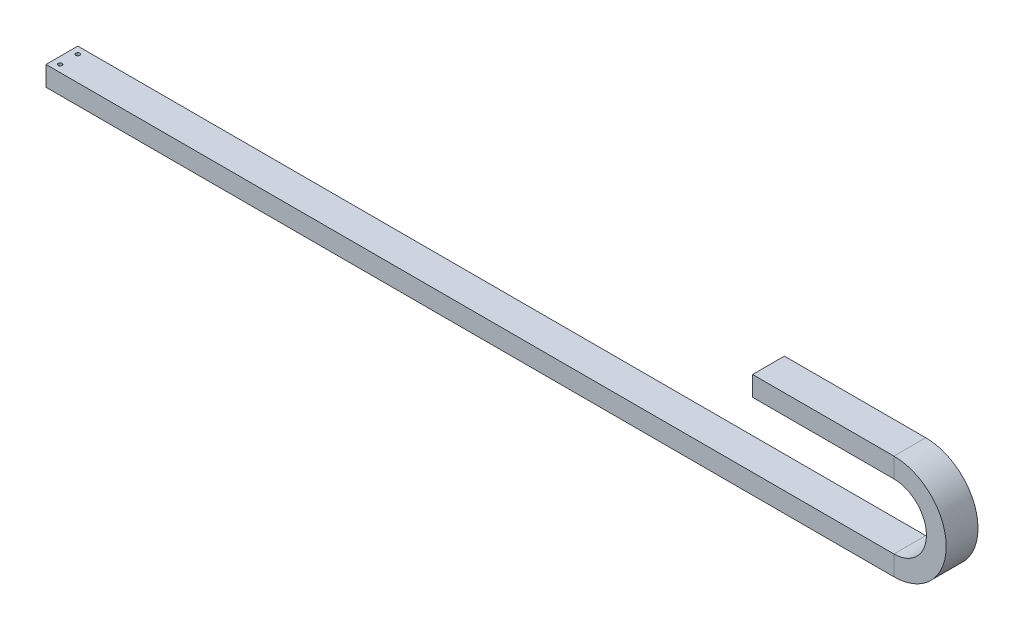
ISO-10303-21;
HEADER;
FILE_DESCRIPTION(('STEP AP214'),'2;1');
FILE_NAME('part.step','',(''),(''),'','','');
FILE_SCHEMA(('AUTOMOTIVE_DESIGN { 1 0 10303 214 1 1 1 1 }'));
ENDSEC;
DATA;
#1=APPLICATION_CONTEXT('core data for automotive mechanical design processes');
#2=APPLICATION_PROTOCOL_DEFINITION('international standard','automotive_design',2000,#1);
#3=PRODUCT_CONTEXT('',#1,'mechanical');
#4=PRODUCT('Part','Part','',(#3));
#5=PRODUCT_RELATED_PRODUCT_CATEGORY('part','',(#4));
#6=PRODUCT_DEFINITION_FORMATION('','',#4);
#7=PRODUCT_DEFINITION_CONTEXT('part definition',#1,'design');
#8=PRODUCT_DEFINITION('design','',#6,#7);
#9=PRODUCT_DEFINITION_SHAPE('','',#8);
#10=(LENGTH_UNIT() NAMED_UNIT(*) SI_UNIT(.MILLI.,.METRE.));
#11=(NAMED_UNIT(*) PLANE_ANGLE_UNIT() SI_UNIT($,.RADIAN.));
#12=(NAMED_UNIT(*) SI_UNIT($,.STERADIAN.) SOLID_ANGLE_UNIT());
#13=UNCERTAINTY_MEASURE_WITH_UNIT(LENGTH_MEASURE(1.E-05),#10,'distance_accuracy_value','');
#14=(GEOMETRIC_REPRESENTATION_CONTEXT(3) GLOBAL_UNCERTAINTY_ASSIGNED_CONTEXT((#13)) GLOBAL_UNIT_ASSIGNED_CONTEXT((#10,
#11,#12)) REPRESENTATION_CONTEXT('',''));
#15=CARTESIAN_POINT('',(0.,0.,0.));
#16=DIRECTION('',(0.,0.,1.));
#17=DIRECTION('',(1.,0.,0.));
#18=AXIS2_PLACEMENT_3D('',#15,#16,#17);
#19=CARTESIAN_POINT('',(0.,-14.,-22.5));
#20=DIRECTION('',(0.,0.,-1.));
#21=DIRECTION('',(-1.,0.,0.));
#22=AXIS2_PLACEMENT_3D('',#19,#20,#21);
#23=PLANE('',#22);
#24=DIRECTION('',(1.,0.,0.));
#25=VECTOR('',#24,1.);
#26=CARTESIAN_POINT('',(0.,14.,-22.5));
#27=LINE('',#26,#25);
#28=CARTESIAN_POINT('',(0.,14.,-22.5));
#29=VERTEX_POINT('',#28);
#30=CARTESIAN_POINT('',(1200.,14.,-22.5));
#31=VERTEX_POINT('',#30);
#32=EDGE_CURVE('E276',#29,#31,#27,.T.);
#33=ORIENTED_EDGE('',*,*,#32,.T.);
#34=DIRECTION('',(0.,1.,0.));
#35=VECTOR('',#34,1.);
#36=CARTESIAN_POINT('',(1200.,-14.,-22.5));
#37=LINE('',#36,#35);
#38=CARTESIAN_POINT('',(1200.,-14.,-22.5));
#39=VERTEX_POINT('',#38);
#40=EDGE_CURVE('E273',#39,#31,#37,.T.);
#41=ORIENTED_EDGE('',*,*,#40,.F.);
#42=DIRECTION('',(1.,0.,0.));
#43=VECTOR('',#42,1.);
#44=CARTESIAN_POINT('',(0.,-14.,-22.5));
#45=LINE('',#44,#43);
#46=CARTESIAN_POINT('',(0.,-14.,-22.5));
#47=VERTEX_POINT('',#46);
#48=EDGE_CURVE('E131',#47,#39,#45,.T.);
#49=ORIENTED_EDGE('',*,*,#48,.F.);
#50=DIRECTION('',(0.,1.,0.));
#51=VECTOR('',#50,1.);
#52=CARTESIAN_POINT('',(0.,-14.,-22.5));
#53=LINE('',#52,#51);
#54=EDGE_CURVE('E157',#47,#29,#53,.T.);
#55=ORIENTED_EDGE('',*,*,#54,.T.);
#56=EDGE_LOOP('',(#33,#41,#49,#55));
#57=FACE_BOUND('',#56,.T.);
#58=ADVANCED_FACE('F35',(#57),#23,.T.);
#59=CARTESIAN_POINT('',(0.,14.,22.5));
#60=DIRECTION('',(0.,1.,0.));
#61=DIRECTION('',(0.,0.,1.));
#62=AXIS2_PLACEMENT_3D('',#59,#60,#61);
#63=PLANE('',#62);
#64=CARTESIAN_POINT('',(10.,14.,-12.5));
#65=DIRECTION('',(0.,1.,0.));
#66=DIRECTION('',(0.,0.,1.));
#67=AXIS2_PLACEMENT_3D('',#64,#65,#66);
#68=CIRCLE('',#67,2.75);
#69=CARTESIAN_POINT('',(10.,14.,-9.75));
#70=VERTEX_POINT('',#69);
#71=EDGE_CURVE('E377',#70,#70,#68,.T.);
#72=ORIENTED_EDGE('',*,*,#71,.F.);
#73=EDGE_LOOP('',(#72));
#74=FACE_BOUND('',#73,.T.);
#75=CARTESIAN_POINT('',(10.,14.,12.5));
#76=DIRECTION('',(0.,1.,0.));
#77=DIRECTION('',(0.,0.,1.));
#78=AXIS2_PLACEMENT_3D('',#75,#76,#77);
#79=CIRCLE('',#78,2.75);
#80=CARTESIAN_POINT('',(10.,14.,15.25));
#81=VERTEX_POINT('',#80);
#82=EDGE_CURVE('E169',#81,#81,#79,.T.);
#83=ORIENTED_EDGE('',*,*,#82,.F.);
#84=EDGE_LOOP('',(#83));
#85=FACE_BOUND('',#84,.T.);
#86=DIRECTION('',(1.,0.,0.));
#87=VECTOR('',#86,1.);
#88=CARTESIAN_POINT('',(0.,14.,22.5));
#89=LINE('',#88,#87);
#90=CARTESIAN_POINT('',(0.,14.,22.5));
#91=VERTEX_POINT('',#90);
#92=CARTESIAN_POINT('',(1200.,14.,22.5));
#93=VERTEX_POINT('',#92);
#94=EDGE_CURVE('E146',#91,#93,#89,.T.);
#95=ORIENTED_EDGE('',*,*,#94,.T.);
#96=DIRECTION('',(0.,0.,1.));
#97=VECTOR('',#96,1.);
#98=CARTESIAN_POINT('',(1200.,14.,22.5));
#99=LINE('',#98,#97);
#100=EDGE_CURVE('E148',#31,#93,#99,.T.);
#101=ORIENTED_EDGE('',*,*,#100,.F.);
#102=ORIENTED_EDGE('',*,*,#32,.F.);
#103=DIRECTION('',(0.,0.,1.));
#104=VECTOR('',#103,1.);
#105=CARTESIAN_POINT('',(0.,14.,22.5));
#106=LINE('',#105,#104);
#107=EDGE_CURVE('E270',#29,#91,#106,.T.);
#108=ORIENTED_EDGE('',*,*,#107,.T.);
#109=EDGE_LOOP('',(#95,#101,#102,#108));
#110=FACE_BOUND('',#109,.T.);
#111=ADVANCED_FACE('F349',(#74,#85,#110),#63,.T.);
#112=CARTESIAN_POINT('',(0.,-14.,22.5));
#113=DIRECTION('',(0.,0.,1.));
#114=DIRECTION('',(1.,0.,0.));
#115=AXIS2_PLACEMENT_3D('',#112,#113,#114);
#116=PLANE('',#115);
#117=DIRECTION('',(1.,0.,0.));
#118=VECTOR('',#117,1.);
#119=CARTESIAN_POINT('',(0.,-14.,22.5));
#120=LINE('',#119,#118);
#121=CARTESIAN_POINT('',(0.,-14.,22.5));
#122=VERTEX_POINT('',#121);
#123=CARTESIAN_POINT('',(1200.,-14.,22.5));
#124=VERTEX_POINT('',#123);
#125=EDGE_CURVE('E128',#122,#124,#120,.T.);
#126=ORIENTED_EDGE('',*,*,#125,.T.);
#127=DIRECTION('',(0.,-1.,0.));
#128=VECTOR('',#127,1.);
#129=CARTESIAN_POINT('',(1200.,-14.,22.5));
#130=LINE('',#129,#128);
#131=EDGE_CURVE('E138',#93,#124,#130,.T.);
#132=ORIENTED_EDGE('',*,*,#131,.F.);
#133=ORIENTED_EDGE('',*,*,#94,.F.);
#134=DIRECTION('',(0.,-1.,0.));
#135=VECTOR('',#134,1.);
#136=CARTESIAN_POINT('',(0.,-14.,22.5));
#137=LINE('',#136,#135);
#138=EDGE_CURVE('E141',#91,#122,#137,.T.);
#139=ORIENTED_EDGE('',*,*,#138,.T.);
#140=EDGE_LOOP('',(#126,#132,#133,#139));
#141=FACE_BOUND('',#140,.T.);
#142=ADVANCED_FACE('F136',(#141),#116,.T.);
#143=CARTESIAN_POINT('',(0.,-14.,22.5));
#144=DIRECTION('',(0.,-1.,0.));
#145=DIRECTION('',(0.,0.,-1.));
#146=AXIS2_PLACEMENT_3D('',#143,#144,#145);
#147=PLANE('',#146);
#148=CARTESIAN_POINT('',(10.,-14.,-12.5));
#149=DIRECTION('',(0.,1.,0.));
#150=DIRECTION('',(0.,0.,1.));
#151=AXIS2_PLACEMENT_3D('',#148,#149,#150);
#152=CIRCLE('',#151,2.74999999999999);
#153=CARTESIAN_POINT('',(10.,-14.,-9.75000000000001));
#154=VERTEX_POINT('',#153);
#155=EDGE_CURVE('E375',#154,#154,#152,.T.);
#156=ORIENTED_EDGE('',*,*,#155,.T.);
#157=EDGE_LOOP('',(#156));
#158=FACE_BOUND('',#157,.T.);
#159=CARTESIAN_POINT('',(10.,-14.,12.5));
#160=DIRECTION('',(0.,1.,0.));
#161=DIRECTION('',(0.,0.,1.));
#162=AXIS2_PLACEMENT_3D('',#159,#160,#161);
#163=CIRCLE('',#162,2.74999999999999);
#164=CARTESIAN_POINT('',(10.,-14.,15.25));
#165=VERTEX_POINT('',#164);
#166=EDGE_CURVE('E163',#165,#165,#163,.T.);
#167=ORIENTED_EDGE('',*,*,#166,.T.);
#168=EDGE_LOOP('',(#167));
#169=FACE_BOUND('',#168,.T.);
#170=DIRECTION('',(0.,0.,-1.));
#171=VECTOR('',#170,1.);
#172=CARTESIAN_POINT('',(1200.,-14.,22.5));
#173=LINE('',#172,#171);
#174=EDGE_CURVE('E113',#124,#39,#173,.T.);
#175=ORIENTED_EDGE('',*,*,#174,.F.);
#176=ORIENTED_EDGE('',*,*,#125,.F.);
#177=DIRECTION('',(0.,0.,-1.));
#178=VECTOR('',#177,1.);
#179=CARTESIAN_POINT('',(0.,-14.,22.5));
#180=LINE('',#179,#178);
#181=EDGE_CURVE('E263',#122,#47,#180,.T.);
#182=ORIENTED_EDGE('',*,*,#181,.T.);
#183=ORIENTED_EDGE('',*,*,#48,.T.);
#184=EDGE_LOOP('',(#175,#176,#182,#183));
#185=FACE_BOUND('',#184,.T.);
#186=ADVANCED_FACE('F127',(#158,#169,#185),#147,.T.);
#187=CARTESIAN_POINT('',(1200.,-14.,-22.5));
#188=DIRECTION('',(0.,0.,-1.));
#189=DIRECTION('',(-1.,0.,0.));
#190=AXIS2_PLACEMENT_3D('',#187,#188,#189);
#191=PLANE('',#190);
#192=CARTESIAN_POINT('',(1200.,60.,-22.5));
#193=DIRECTION('',(0.,0.,1.));
#194=DIRECTION('',(0.,-1.,0.));
#195=AXIS2_PLACEMENT_3D('',#192,#193,#194);
#196=CIRCLE('',#195,46.);
#197=CARTESIAN_POINT('',(1200.,106.,-22.5));
#198=VERTEX_POINT('',#197);
#199=EDGE_CURVE('E283',#31,#198,#196,.T.);
#200=ORIENTED_EDGE('',*,*,#199,.T.);
#201=DIRECTION('',(0.,-1.,0.));
#202=VECTOR('',#201,1.);
#203=CARTESIAN_POINT('',(1200.,134.,-22.5));
#204=LINE('',#203,#202);
#205=CARTESIAN_POINT('',(1200.,134.,-22.5));
#206=VERTEX_POINT('',#205);
#207=EDGE_CURVE('E280',#206,#198,#204,.T.);
#208=ORIENTED_EDGE('',*,*,#207,.F.);
#209=CARTESIAN_POINT('',(1200.,60.,-22.5));
#210=DIRECTION('',(0.,0.,1.));
#211=DIRECTION('',(0.,-1.,0.));
#212=AXIS2_PLACEMENT_3D('',#209,#210,#211);
#213=CIRCLE('',#212,74.);
#214=EDGE_CURVE('E132',#39,#206,#213,.T.);
#215=ORIENTED_EDGE('',*,*,#214,.F.);
#216=ORIENTED_EDGE('',*,*,#40,.T.);
#217=EDGE_LOOP('',(#200,#208,#215,#216));
#218=FACE_BOUND('',#217,.T.);
#219=ADVANCED_FACE('F351',(#218),#191,.T.);
#220=CARTESIAN_POINT('',(1200.,60.,0.));
#221=DIRECTION('',(0.,0.,1.));
#222=DIRECTION('',(1.,0.,0.));
#223=AXIS2_PLACEMENT_3D('',#220,#221,#222);
#224=CYLINDRICAL_SURFACE('',#223,46.);
#225=CARTESIAN_POINT('',(1200.,60.,22.5));
#226=DIRECTION('',(0.,0.,1.));
#227=DIRECTION('',(0.,-1.,0.));
#228=AXIS2_PLACEMENT_3D('',#225,#226,#227);
#229=CIRCLE('',#228,46.);
#230=CARTESIAN_POINT('',(1200.,106.,22.5));
#231=VERTEX_POINT('',#230);
#232=EDGE_CURVE('E145',#93,#231,#229,.T.);
#233=ORIENTED_EDGE('',*,*,#232,.T.);
#234=DIRECTION('',(0.,0.,1.));
#235=VECTOR('',#234,1.);
#236=CARTESIAN_POINT('',(1200.,106.,22.5));
#237=LINE('',#236,#235);
#238=EDGE_CURVE('E286',#198,#231,#237,.T.);
#239=ORIENTED_EDGE('',*,*,#238,.F.);
#240=ORIENTED_EDGE('',*,*,#199,.F.);
#241=ORIENTED_EDGE('',*,*,#100,.T.);
#242=EDGE_LOOP('',(#233,#239,#240,#241));
#243=FACE_BOUND('',#242,.T.);
#244=ADVANCED_FACE('F298',(#243),#224,.F.);
#245=CARTESIAN_POINT('',(1200.,-14.,22.5));
#246=DIRECTION('',(0.,0.,1.));
#247=DIRECTION('',(1.,0.,0.));
#248=AXIS2_PLACEMENT_3D('',#245,#246,#247);
#249=PLANE('',#248);
#250=CARTESIAN_POINT('',(1200.,60.,22.5));
#251=DIRECTION('',(0.,0.,1.));
#252=DIRECTION('',(0.,-1.,0.));
#253=AXIS2_PLACEMENT_3D('',#250,#251,#252);
#254=CIRCLE('',#253,74.);
#255=CARTESIAN_POINT('',(1200.,134.,22.5));
#256=VERTEX_POINT('',#255);
#257=EDGE_CURVE('E109',#124,#256,#254,.T.);
#258=ORIENTED_EDGE('',*,*,#257,.T.);
#259=DIRECTION('',(0.,1.,0.));
#260=VECTOR('',#259,1.);
#261=CARTESIAN_POINT('',(1200.,134.,22.5));
#262=LINE('',#261,#260);
#263=EDGE_CURVE('E121',#231,#256,#262,.T.);
#264=ORIENTED_EDGE('',*,*,#263,.F.);
#265=ORIENTED_EDGE('',*,*,#232,.F.);
#266=ORIENTED_EDGE('',*,*,#131,.T.);
#267=EDGE_LOOP('',(#258,#264,#265,#266));
#268=FACE_BOUND('',#267,.T.);
#269=ADVANCED_FACE('F143',(#268),#249,.T.);
#270=CARTESIAN_POINT('',(1200.,60.,0.));
#271=DIRECTION('',(0.,0.,1.));
#272=DIRECTION('',(1.,0.,0.));
#273=AXIS2_PLACEMENT_3D('',#270,#271,#272);
#274=CYLINDRICAL_SURFACE('',#273,74.);
#275=DIRECTION('',(0.,0.,-1.));
#276=VECTOR('',#275,1.);
#277=CARTESIAN_POINT('',(1200.,134.,22.5));
#278=LINE('',#277,#276);
#279=EDGE_CURVE('E116',#256,#206,#278,.T.);
#280=ORIENTED_EDGE('',*,*,#279,.F.);
#281=ORIENTED_EDGE('',*,*,#257,.F.);
#282=ORIENTED_EDGE('',*,*,#174,.T.);
#283=ORIENTED_EDGE('',*,*,#214,.T.);
#284=EDGE_LOOP('',(#280,#281,#282,#283));
#285=FACE_BOUND('',#284,.T.);
#286=ADVANCED_FACE('F111',(#285),#274,.T.);
#287=CARTESIAN_POINT('',(1200.,134.,-22.5));
#288=DIRECTION('',(0.,0.,-1.));
#289=DIRECTION('',(-1.,0.,0.));
#290=AXIS2_PLACEMENT_3D('',#287,#288,#289);
#291=PLANE('',#290);
#292=DIRECTION('',(-1.,0.,0.));
#293=VECTOR('',#292,1.);
#294=CARTESIAN_POINT('',(1200.,106.,-22.5));
#295=LINE('',#294,#293);
#296=CARTESIAN_POINT('',(1000.,106.,-22.5));
#297=VERTEX_POINT('',#296);
#298=EDGE_CURVE('E288',#198,#297,#295,.T.);
#299=ORIENTED_EDGE('',*,*,#298,.T.);
#300=DIRECTION('',(0.,-1.,0.));
#301=VECTOR('',#300,1.);
#302=CARTESIAN_POINT('',(1000.,134.,-22.5));
#303=LINE('',#302,#301);
#304=CARTESIAN_POINT('',(1000.,134.,-22.5));
#305=VERTEX_POINT('',#304);
#306=EDGE_CURVE('E259',#305,#297,#303,.T.);
#307=ORIENTED_EDGE('',*,*,#306,.F.);
#308=DIRECTION('',(-1.,0.,0.));
#309=VECTOR('',#308,1.);
#310=CARTESIAN_POINT('',(1200.,134.,-22.5));
#311=LINE('',#310,#309);
#312=EDGE_CURVE('E159',#206,#305,#311,.T.);
#313=ORIENTED_EDGE('',*,*,#312,.F.);
#314=ORIENTED_EDGE('',*,*,#207,.T.);
#315=EDGE_LOOP('',(#299,#307,#313,#314));
#316=FACE_BOUND('',#315,.T.);
#317=ADVANCED_FACE('F304',(#316),#291,.T.);
#318=CARTESIAN_POINT('',(1200.,106.,22.5));
#319=DIRECTION('',(0.,-1.,0.));
#320=DIRECTION('',(1.,0.,0.));
#321=AXIS2_PLACEMENT_3D('',#318,#319,#320);
#322=PLANE('',#321);
#323=DIRECTION('',(-1.,0.,0.));
#324=VECTOR('',#323,1.);
#325=CARTESIAN_POINT('',(1200.,106.,22.5));
#326=LINE('',#325,#324);
#327=CARTESIAN_POINT('',(1000.,106.,22.5));
#328=VERTEX_POINT('',#327);
#329=EDGE_CURVE('E151',#231,#328,#326,.T.);
#330=ORIENTED_EDGE('',*,*,#329,.T.);
#331=DIRECTION('',(0.,0.,1.));
#332=VECTOR('',#331,1.);
#333=CARTESIAN_POINT('',(1000.,106.,22.5));
#334=LINE('',#333,#332);
#335=EDGE_CURVE('E262',#297,#328,#334,.T.);
#336=ORIENTED_EDGE('',*,*,#335,.F.);
#337=ORIENTED_EDGE('',*,*,#298,.F.);
#338=ORIENTED_EDGE('',*,*,#238,.T.);
#339=EDGE_LOOP('',(#330,#336,#337,#338));
#340=FACE_BOUND('',#339,.T.);
#341=ADVANCED_FACE('F302',(#340),#322,.T.);
#342=CARTESIAN_POINT('',(1200.,134.,22.5));
#343=DIRECTION('',(0.,0.,1.));
#344=DIRECTION('',(1.,0.,0.));
#345=AXIS2_PLACEMENT_3D('',#342,#343,#344);
#346=PLANE('',#345);
#347=DIRECTION('',(-1.,0.,0.));
#348=VECTOR('',#347,1.);
#349=CARTESIAN_POINT('',(1200.,134.,22.5));
#350=LINE('',#349,#348);
#351=CARTESIAN_POINT('',(1000.,134.,22.5));
#352=VERTEX_POINT('',#351);
#353=EDGE_CURVE('E155',#256,#352,#350,.T.);
#354=ORIENTED_EDGE('',*,*,#353,.T.);
#355=DIRECTION('',(0.,1.,0.));
#356=VECTOR('',#355,1.);
#357=CARTESIAN_POINT('',(1000.,134.,22.5));
#358=LINE('',#357,#356);
#359=EDGE_CURVE('E258',#328,#352,#358,.T.);
#360=ORIENTED_EDGE('',*,*,#359,.F.);
#361=ORIENTED_EDGE('',*,*,#329,.F.);
#362=ORIENTED_EDGE('',*,*,#263,.T.);
#363=EDGE_LOOP('',(#354,#360,#361,#362));
#364=FACE_BOUND('',#363,.T.);
#365=ADVANCED_FACE('F311',(#364),#346,.T.);
#366=CARTESIAN_POINT('',(1200.,134.,22.5));
#367=DIRECTION('',(0.,1.,0.));
#368=DIRECTION('',(-1.,0.,0.));
#369=AXIS2_PLACEMENT_3D('',#366,#367,#368);
#370=PLANE('',#369);
#371=DIRECTION('',(0.,0.,-1.));
#372=VECTOR('',#371,1.);
#373=CARTESIAN_POINT('',(1000.,134.,22.5));
#374=LINE('',#373,#372);
#375=EDGE_CURVE('E182',#352,#305,#374,.T.);
#376=ORIENTED_EDGE('',*,*,#375,.F.);
#377=ORIENTED_EDGE('',*,*,#353,.F.);
#378=ORIENTED_EDGE('',*,*,#279,.T.);
#379=ORIENTED_EDGE('',*,*,#312,.T.);
#380=EDGE_LOOP('',(#376,#377,#378,#379));
#381=FACE_BOUND('',#380,.T.);
#382=ADVANCED_FACE('F37',(#381),#370,.T.);
#383=CARTESIAN_POINT('',(0.,0.,0.));
#384=DIRECTION('',(-1.,0.,0.));
#385=DIRECTION('',(0.,0.,1.));
#386=AXIS2_PLACEMENT_3D('',#383,#384,#385);
#387=PLANE('',#386);
#388=ORIENTED_EDGE('',*,*,#54,.F.);
#389=ORIENTED_EDGE('',*,*,#181,.F.);
#390=ORIENTED_EDGE('',*,*,#138,.F.);
#391=ORIENTED_EDGE('',*,*,#107,.F.);
#392=EDGE_LOOP('',(#388,#389,#390,#391));
#393=FACE_BOUND('',#392,.T.);
#394=DIRECTION('',(0.,-1.,0.));
#395=VECTOR('',#394,1.);
#396=CARTESIAN_POINT('',(0.,-9.,17.5));
#397=LINE('',#396,#395);
#398=CARTESIAN_POINT('',(0.,-9.,17.5));
#399=VERTEX_POINT('',#398);
#400=CARTESIAN_POINT('',(0.,9.,17.5));
#401=VERTEX_POINT('',#400);
#402=EDGE_CURVE('E193',#399,#401,#397,.F.);
#403=ORIENTED_EDGE('',*,*,#402,.F.);
#404=DIRECTION('',(0.,0.,-1.));
#405=VECTOR('',#404,1.);
#406=CARTESIAN_POINT('',(0.,-9.,-17.5));
#407=LINE('',#406,#405);
#408=CARTESIAN_POINT('',(0.,-9.,-17.5));
#409=VERTEX_POINT('',#408);
#410=EDGE_CURVE('E218',#409,#399,#407,.F.);
#411=ORIENTED_EDGE('',*,*,#410,.F.);
#412=DIRECTION('',(0.,1.,0.));
#413=VECTOR('',#412,1.);
#414=CARTESIAN_POINT('',(0.,-9.,-17.5));
#415=LINE('',#414,#413);
#416=CARTESIAN_POINT('',(0.,9.,-17.5));
#417=VERTEX_POINT('',#416);
#418=EDGE_CURVE('E181',#417,#409,#415,.F.);
#419=ORIENTED_EDGE('',*,*,#418,.F.);
#420=DIRECTION('',(0.,0.,1.));
#421=VECTOR('',#420,1.);
#422=CARTESIAN_POINT('',(0.,9.,-17.5));
#423=LINE('',#422,#421);
#424=EDGE_CURVE('E178',#401,#417,#423,.F.);
#425=ORIENTED_EDGE('',*,*,#424,.F.);
#426=EDGE_LOOP('',(#403,#411,#419,#425));
#427=FACE_BOUND('',#426,.T.);
#428=ADVANCED_FACE('F318',(#393,#427),#387,.T.);
#429=CARTESIAN_POINT('',(1000.,120.,0.));
#430=DIRECTION('',(1.,0.,0.));
#431=DIRECTION('',(0.,0.,1.));
#432=AXIS2_PLACEMENT_3D('',#429,#430,#431);
#433=PLANE('',#432);
#434=ORIENTED_EDGE('',*,*,#306,.T.);
#435=ORIENTED_EDGE('',*,*,#335,.T.);
#436=ORIENTED_EDGE('',*,*,#359,.T.);
#437=ORIENTED_EDGE('',*,*,#375,.T.);
#438=EDGE_LOOP('',(#434,#435,#436,#437));
#439=FACE_BOUND('',#438,.T.);
#440=DIRECTION('',(0.,1.,0.));
#441=VECTOR('',#440,1.);
#442=CARTESIAN_POINT('',(1000.,129.,17.5));
#443=LINE('',#442,#441);
#444=CARTESIAN_POINT('',(1000.,129.,17.5));
#445=VERTEX_POINT('',#444);
#446=CARTESIAN_POINT('',(1000.,111.,17.5));
#447=VERTEX_POINT('',#446);
#448=EDGE_CURVE('E11',#445,#447,#443,.F.);
#449=ORIENTED_EDGE('',*,*,#448,.T.);
#450=DIRECTION('',(0.,0.,1.));
#451=VECTOR('',#450,1.);
#452=CARTESIAN_POINT('',(1000.,111.,-17.5));
#453=LINE('',#452,#451);
#454=CARTESIAN_POINT('',(1000.,111.,-17.5));
#455=VERTEX_POINT('',#454);
#456=EDGE_CURVE('E205',#447,#455,#453,.F.);
#457=ORIENTED_EDGE('',*,*,#456,.T.);
#458=DIRECTION('',(0.,-1.,0.));
#459=VECTOR('',#458,1.);
#460=CARTESIAN_POINT('',(1000.,129.,-17.5));
#461=LINE('',#460,#459);
#462=CARTESIAN_POINT('',(1000.,129.,-17.5));
#463=VERTEX_POINT('',#462);
#464=EDGE_CURVE('E212',#455,#463,#461,.F.);
#465=ORIENTED_EDGE('',*,*,#464,.T.);
#466=DIRECTION('',(0.,0.,-1.));
#467=VECTOR('',#466,1.);
#468=CARTESIAN_POINT('',(1000.,129.,-17.5));
#469=LINE('',#468,#467);
#470=EDGE_CURVE('E53',#463,#445,#469,.F.);
#471=ORIENTED_EDGE('',*,*,#470,.T.);
#472=EDGE_LOOP('',(#449,#457,#465,#471));
#473=FACE_BOUND('',#472,.T.);
#474=ADVANCED_FACE('F307',(#439,#473),#433,.F.);
#475=CARTESIAN_POINT('',(0.,9.,-17.5));
#476=DIRECTION('',(0.,-1.,0.));
#477=DIRECTION('',(0.,0.,-1.));
#478=AXIS2_PLACEMENT_3D('',#475,#476,#477);
#479=PLANE('',#478);
#480=CARTESIAN_POINT('',(10.,9.,-12.5));
#481=DIRECTION('',(0.,-1.,0.));
#482=DIRECTION('',(0.,0.,-1.));
#483=AXIS2_PLACEMENT_3D('',#480,#481,#482);
#484=CIRCLE('',#483,2.75);
#485=CARTESIAN_POINT('',(10.,9.,-15.25));
#486=VERTEX_POINT('',#485);
#487=EDGE_CURVE('E174',#486,#486,#484,.T.);
#488=ORIENTED_EDGE('',*,*,#487,.F.);
#489=EDGE_LOOP('',(#488));
#490=FACE_BOUND('',#489,.T.);
#491=CARTESIAN_POINT('',(10.,9.,12.5));
#492=DIRECTION('',(0.,-1.,0.));
#493=DIRECTION('',(0.,0.,-1.));
#494=AXIS2_PLACEMENT_3D('',#491,#492,#493);
#495=CIRCLE('',#494,2.75);
#496=CARTESIAN_POINT('',(10.,9.,9.75000000000001));
#497=VERTEX_POINT('',#496);
#498=EDGE_CURVE('E160',#497,#497,#495,.T.);
#499=ORIENTED_EDGE('',*,*,#498,.F.);
#500=EDGE_LOOP('',(#499));
#501=FACE_BOUND('',#500,.T.);
#502=DIRECTION('',(1.,0.,0.));
#503=VECTOR('',#502,1.);
#504=CARTESIAN_POINT('',(0.,9.,-17.5));
#505=LINE('',#504,#503);
#506=CARTESIAN_POINT('',(1200.,9.,-17.5));
#507=VERTEX_POINT('',#506);
#508=EDGE_CURVE('E186',#417,#507,#505,.T.);
#509=ORIENTED_EDGE('',*,*,#508,.T.);
#510=DIRECTION('',(0.,0.,1.));
#511=VECTOR('',#510,1.);
#512=CARTESIAN_POINT('',(1200.,9.,-17.5));
#513=LINE('',#512,#511);
#514=CARTESIAN_POINT('',(1200.,9.,17.5));
#515=VERTEX_POINT('',#514);
#516=EDGE_CURVE('E183',#515,#507,#513,.F.);
#517=ORIENTED_EDGE('',*,*,#516,.F.);
#518=DIRECTION('',(1.,0.,0.));
#519=VECTOR('',#518,1.);
#520=CARTESIAN_POINT('',(0.,9.,17.5));
#521=LINE('',#520,#519);
#522=EDGE_CURVE('E187',#401,#515,#521,.T.);
#523=ORIENTED_EDGE('',*,*,#522,.F.);
#524=ORIENTED_EDGE('',*,*,#424,.T.);
#525=EDGE_LOOP('',(#509,#517,#523,#524));
#526=FACE_BOUND('',#525,.T.);
#527=ADVANCED_FACE('F343',(#490,#501,#526),#479,.T.);
#528=CARTESIAN_POINT('',(0.,-9.,-17.5));
#529=DIRECTION('',(0.,0.,1.));
#530=DIRECTION('',(1.,0.,0.));
#531=AXIS2_PLACEMENT_3D('',#528,#529,#530);
#532=PLANE('',#531);
#533=DIRECTION('',(1.,0.,0.));
#534=VECTOR('',#533,1.);
#535=CARTESIAN_POINT('',(0.,-9.,-17.5));
#536=LINE('',#535,#534);
#537=CARTESIAN_POINT('',(1200.,-9.,-17.5));
#538=VERTEX_POINT('',#537);
#539=EDGE_CURVE('E221',#409,#538,#536,.T.);
#540=ORIENTED_EDGE('',*,*,#539,.T.);
#541=DIRECTION('',(0.,1.,0.));
#542=VECTOR('',#541,1.);
#543=CARTESIAN_POINT('',(1200.,-9.,-17.5));
#544=LINE('',#543,#542);
#545=EDGE_CURVE('E190',#507,#538,#544,.F.);
#546=ORIENTED_EDGE('',*,*,#545,.F.);
#547=ORIENTED_EDGE('',*,*,#508,.F.);
#548=ORIENTED_EDGE('',*,*,#418,.T.);
#549=EDGE_LOOP('',(#540,#546,#547,#548));
#550=FACE_BOUND('',#549,.T.);
#551=ADVANCED_FACE('F390',(#550),#532,.T.);
#552=CARTESIAN_POINT('',(0.,-9.,-17.5));
#553=DIRECTION('',(0.,1.,0.));
#554=DIRECTION('',(0.,0.,1.));
#555=AXIS2_PLACEMENT_3D('',#552,#553,#554);
#556=PLANE('',#555);
#557=CARTESIAN_POINT('',(10.,-9.,-12.5));
#558=DIRECTION('',(0.,1.,0.));
#559=DIRECTION('',(0.,0.,1.));
#560=AXIS2_PLACEMENT_3D('',#557,#558,#559);
#561=CIRCLE('',#560,2.75);
#562=CARTESIAN_POINT('',(10.,-9.,-9.75000000000001));
#563=VERTEX_POINT('',#562);
#564=EDGE_CURVE('E39',#563,#563,#561,.T.);
#565=ORIENTED_EDGE('',*,*,#564,.F.);
#566=EDGE_LOOP('',(#565));
#567=FACE_BOUND('',#566,.T.);
#568=CARTESIAN_POINT('',(10.,-9.,12.5));
#569=DIRECTION('',(0.,1.,0.));
#570=DIRECTION('',(0.,0.,1.));
#571=AXIS2_PLACEMENT_3D('',#568,#569,#570);
#572=CIRCLE('',#571,2.75);
#573=CARTESIAN_POINT('',(10.,-9.,15.25));
#574=VERTEX_POINT('',#573);
#575=EDGE_CURVE('E162',#574,#574,#572,.T.);
#576=ORIENTED_EDGE('',*,*,#575,.F.);
#577=EDGE_LOOP('',(#576));
#578=FACE_BOUND('',#577,.T.);
#579=DIRECTION('',(1.,0.,0.));
#580=VECTOR('',#579,1.);
#581=CARTESIAN_POINT('',(0.,-9.,17.5));
#582=LINE('',#581,#580);
#583=CARTESIAN_POINT('',(1200.,-9.,17.5));
#584=VERTEX_POINT('',#583);
#585=EDGE_CURVE('E239',#399,#584,#582,.T.);
#586=ORIENTED_EDGE('',*,*,#585,.T.);
#587=DIRECTION('',(0.,0.,-1.));
#588=VECTOR('',#587,1.);
#589=CARTESIAN_POINT('',(1200.,-9.,-17.5));
#590=LINE('',#589,#588);
#591=EDGE_CURVE('E224',#538,#584,#590,.F.);
#592=ORIENTED_EDGE('',*,*,#591,.F.);
#593=ORIENTED_EDGE('',*,*,#539,.F.);
#594=ORIENTED_EDGE('',*,*,#410,.T.);
#595=EDGE_LOOP('',(#586,#592,#593,#594));
#596=FACE_BOUND('',#595,.T.);
#597=ADVANCED_FACE('F423',(#567,#578,#596),#556,.T.);
#598=CARTESIAN_POINT('',(0.,-9.,17.5));
#599=DIRECTION('',(0.,0.,-1.));
#600=DIRECTION('',(-1.,0.,0.));
#601=AXIS2_PLACEMENT_3D('',#598,#599,#600);
#602=PLANE('',#601);
#603=DIRECTION('',(0.,-1.,0.));
#604=VECTOR('',#603,1.);
#605=CARTESIAN_POINT('',(1200.,-9.,17.5));
#606=LINE('',#605,#604);
#607=EDGE_CURVE('E204',#584,#515,#606,.F.);
#608=ORIENTED_EDGE('',*,*,#607,.F.);
#609=ORIENTED_EDGE('',*,*,#585,.F.);
#610=ORIENTED_EDGE('',*,*,#402,.T.);
#611=ORIENTED_EDGE('',*,*,#522,.T.);
#612=EDGE_LOOP('',(#608,#609,#610,#611));
#613=FACE_BOUND('',#612,.T.);
#614=ADVANCED_FACE('F420',(#613),#602,.T.);
#615=CARTESIAN_POINT('',(1200.,60.,0.));
#616=DIRECTION('',(0.,0.,1.));
#617=DIRECTION('',(1.,0.,0.));
#618=AXIS2_PLACEMENT_3D('',#615,#616,#617);
#619=CYLINDRICAL_SURFACE('',#618,51.);
#620=CARTESIAN_POINT('',(1200.,60.,-17.5));
#621=DIRECTION('',(0.,0.,1.));
#622=DIRECTION('',(0.,-1.,0.));
#623=AXIS2_PLACEMENT_3D('',#620,#621,#622);
#624=CIRCLE('',#623,51.);
#625=CARTESIAN_POINT('',(1200.,111.,-17.5));
#626=VERTEX_POINT('',#625);
#627=EDGE_CURVE('E197',#507,#626,#624,.T.);
#628=ORIENTED_EDGE('',*,*,#627,.T.);
#629=DIRECTION('',(0.,0.,1.));
#630=VECTOR('',#629,1.);
#631=CARTESIAN_POINT('',(1200.,111.,-17.5));
#632=LINE('',#631,#630);
#633=CARTESIAN_POINT('',(1200.,111.,17.5));
#634=VERTEX_POINT('',#633);
#635=EDGE_CURVE('E194',#634,#626,#632,.F.);
#636=ORIENTED_EDGE('',*,*,#635,.F.);
#637=CARTESIAN_POINT('',(1200.,60.,17.5));
#638=DIRECTION('',(0.,0.,1.));
#639=DIRECTION('',(0.,-1.,0.));
#640=AXIS2_PLACEMENT_3D('',#637,#638,#639);
#641=CIRCLE('',#640,51.);
#642=EDGE_CURVE('E198',#515,#634,#641,.T.);
#643=ORIENTED_EDGE('',*,*,#642,.F.);
#644=ORIENTED_EDGE('',*,*,#516,.T.);
#645=EDGE_LOOP('',(#628,#636,#643,#644));
#646=FACE_BOUND('',#645,.T.);
#647=ADVANCED_FACE('F407',(#646),#619,.T.);
#648=CARTESIAN_POINT('',(1200.,-9.00000000000001,-17.5));
#649=DIRECTION('',(0.,0.,1.));
#650=DIRECTION('',(1.,0.,0.));
#651=AXIS2_PLACEMENT_3D('',#648,#649,#650);
#652=PLANE('',#651);
#653=CARTESIAN_POINT('',(1200.,60.,-17.5));
#654=DIRECTION('',(0.,0.,1.));
#655=DIRECTION('',(0.,-1.,0.));
#656=AXIS2_PLACEMENT_3D('',#653,#654,#655);
#657=CIRCLE('',#656,69.);
#658=CARTESIAN_POINT('',(1200.,129.,-17.5));
#659=VERTEX_POINT('',#658);
#660=EDGE_CURVE('E227',#538,#659,#657,.T.);
#661=ORIENTED_EDGE('',*,*,#660,.T.);
#662=DIRECTION('',(0.,-1.,0.));
#663=VECTOR('',#662,1.);
#664=CARTESIAN_POINT('',(1200.,129.,-17.5));
#665=LINE('',#664,#663);
#666=EDGE_CURVE('E201',#626,#659,#665,.F.);
#667=ORIENTED_EDGE('',*,*,#666,.F.);
#668=ORIENTED_EDGE('',*,*,#627,.F.);
#669=ORIENTED_EDGE('',*,*,#545,.T.);
#670=EDGE_LOOP('',(#661,#667,#668,#669));
#671=FACE_BOUND('',#670,.T.);
#672=ADVANCED_FACE('F434',(#671),#652,.T.);
#673=CARTESIAN_POINT('',(1200.,60.,0.));
#674=DIRECTION('',(0.,0.,1.));
#675=DIRECTION('',(1.,0.,0.));
#676=AXIS2_PLACEMENT_3D('',#673,#674,#675);
#677=CYLINDRICAL_SURFACE('',#676,69.);
#678=CARTESIAN_POINT('',(1200.,60.,17.5));
#679=DIRECTION('',(0.,0.,1.));
#680=DIRECTION('',(0.,-1.,0.));
#681=AXIS2_PLACEMENT_3D('',#678,#679,#680);
#682=CIRCLE('',#681,69.);
#683=CARTESIAN_POINT('',(1200.,129.,17.5));
#684=VERTEX_POINT('',#683);
#685=EDGE_CURVE('E244',#584,#684,#682,.T.);
#686=ORIENTED_EDGE('',*,*,#685,.T.);
#687=DIRECTION('',(0.,0.,-1.));
#688=VECTOR('',#687,1.);
#689=CARTESIAN_POINT('',(1200.,129.,-17.5));
#690=LINE('',#689,#688);
#691=EDGE_CURVE('E230',#659,#684,#690,.F.);
#692=ORIENTED_EDGE('',*,*,#691,.F.);
#693=ORIENTED_EDGE('',*,*,#660,.F.);
#694=ORIENTED_EDGE('',*,*,#591,.T.);
#695=EDGE_LOOP('',(#686,#692,#693,#694));
#696=FACE_BOUND('',#695,.T.);
#697=ADVANCED_FACE('F428',(#696),#677,.F.);
#698=CARTESIAN_POINT('',(1200.,-9.00000000000001,17.5));
#699=DIRECTION('',(0.,0.,-1.));
#700=DIRECTION('',(-1.,0.,0.));
#701=AXIS2_PLACEMENT_3D('',#698,#699,#700);
#702=PLANE('',#701);
#703=DIRECTION('',(0.,1.,0.));
#704=VECTOR('',#703,1.);
#705=CARTESIAN_POINT('',(1200.,129.,17.5));
#706=LINE('',#705,#704);
#707=EDGE_CURVE('E215',#684,#634,#706,.F.);
#708=ORIENTED_EDGE('',*,*,#707,.F.);
#709=ORIENTED_EDGE('',*,*,#685,.F.);
#710=ORIENTED_EDGE('',*,*,#607,.T.);
#711=ORIENTED_EDGE('',*,*,#642,.T.);
#712=EDGE_LOOP('',(#708,#709,#710,#711));
#713=FACE_BOUND('',#712,.T.);
#714=ADVANCED_FACE('F339',(#713),#702,.T.);
#715=CARTESIAN_POINT('',(1200.,111.,-17.5));
#716=DIRECTION('',(0.,1.,0.));
#717=DIRECTION('',(-1.,0.,0.));
#718=AXIS2_PLACEMENT_3D('',#715,#716,#717);
#719=PLANE('',#718);
#720=DIRECTION('',(-1.,0.,0.));
#721=VECTOR('',#720,1.);
#722=CARTESIAN_POINT('',(1200.,111.,-17.5));
#723=LINE('',#722,#721);
#724=EDGE_CURVE('E208',#626,#455,#723,.T.);
#725=ORIENTED_EDGE('',*,*,#724,.T.);
#726=ORIENTED_EDGE('',*,*,#456,.F.);
#727=DIRECTION('',(-1.,0.,0.));
#728=VECTOR('',#727,1.);
#729=CARTESIAN_POINT('',(1200.,111.,17.5));
#730=LINE('',#729,#728);
#731=EDGE_CURVE('E209',#634,#447,#730,.T.);
#732=ORIENTED_EDGE('',*,*,#731,.F.);
#733=ORIENTED_EDGE('',*,*,#635,.T.);
#734=EDGE_LOOP('',(#725,#726,#732,#733));
#735=FACE_BOUND('',#734,.T.);
#736=ADVANCED_FACE('F443',(#735),#719,.T.);
#737=CARTESIAN_POINT('',(1200.,129.,-17.5));
#738=DIRECTION('',(0.,0.,1.));
#739=DIRECTION('',(1.,0.,0.));
#740=AXIS2_PLACEMENT_3D('',#737,#738,#739);
#741=PLANE('',#740);
#742=DIRECTION('',(-1.,0.,0.));
#743=VECTOR('',#742,1.);
#744=CARTESIAN_POINT('',(1200.,129.,-17.5));
#745=LINE('',#744,#743);
#746=EDGE_CURVE('E232',#659,#463,#745,.T.);
#747=ORIENTED_EDGE('',*,*,#746,.T.);
#748=ORIENTED_EDGE('',*,*,#464,.F.);
#749=ORIENTED_EDGE('',*,*,#724,.F.);
#750=ORIENTED_EDGE('',*,*,#666,.T.);
#751=EDGE_LOOP('',(#747,#748,#749,#750));
#752=FACE_BOUND('',#751,.T.);
#753=ADVANCED_FACE('F334',(#752),#741,.T.);
#754=CARTESIAN_POINT('',(1200.,129.,-17.5));
#755=DIRECTION('',(0.,-1.,0.));
#756=DIRECTION('',(1.,0.,0.));
#757=AXIS2_PLACEMENT_3D('',#754,#755,#756);
#758=PLANE('',#757);
#759=DIRECTION('',(-1.,0.,0.));
#760=VECTOR('',#759,1.);
#761=CARTESIAN_POINT('',(1200.,129.,17.5));
#762=LINE('',#761,#760);
#763=EDGE_CURVE('E45',#684,#445,#762,.T.);
#764=ORIENTED_EDGE('',*,*,#763,.T.);
#765=ORIENTED_EDGE('',*,*,#470,.F.);
#766=ORIENTED_EDGE('',*,*,#746,.F.);
#767=ORIENTED_EDGE('',*,*,#691,.T.);
#768=EDGE_LOOP('',(#764,#765,#766,#767));
#769=FACE_BOUND('',#768,.T.);
#770=ADVANCED_FACE('F325',(#769),#758,.T.);
#771=CARTESIAN_POINT('',(1200.,129.,17.5));
#772=DIRECTION('',(0.,0.,-1.));
#773=DIRECTION('',(-1.,0.,0.));
#774=AXIS2_PLACEMENT_3D('',#771,#772,#773);
#775=PLANE('',#774);
#776=ORIENTED_EDGE('',*,*,#448,.F.);
#777=ORIENTED_EDGE('',*,*,#763,.F.);
#778=ORIENTED_EDGE('',*,*,#707,.T.);
#779=ORIENTED_EDGE('',*,*,#731,.T.);
#780=EDGE_LOOP('',(#776,#777,#778,#779));
#781=FACE_BOUND('',#780,.T.);
#782=ADVANCED_FACE('F322',(#781),#775,.T.);
#783=CARTESIAN_POINT('',(10.,14.,12.5));
#784=DIRECTION('',(0.,1.,0.));
#785=DIRECTION('',(0.,0.,1.));
#786=AXIS2_PLACEMENT_3D('',#783,#784,#785);
#787=CYLINDRICAL_SURFACE('',#786,2.75);
#788=ORIENTED_EDGE('',*,*,#498,.T.);
#789=EDGE_LOOP('',(#788));
#790=FACE_BOUND('',#789,.T.);
#791=ORIENTED_EDGE('',*,*,#82,.T.);
#792=EDGE_LOOP('',(#791));
#793=FACE_BOUND('',#792,.T.);
#794=ADVANCED_FACE('F324',(#790,#793),#787,.F.);
#795=ORIENTED_EDGE('',*,*,#575,.T.);
#796=EDGE_LOOP('',(#795));
#797=FACE_BOUND('',#796,.T.);
#798=ORIENTED_EDGE('',*,*,#166,.F.);
#799=EDGE_LOOP('',(#798));
#800=FACE_BOUND('',#799,.T.);
#801=ADVANCED_FACE('F332',(#797,#800),#787,.F.);
#802=CARTESIAN_POINT('',(10.,14.,-12.5));
#803=DIRECTION('',(0.,1.,0.));
#804=DIRECTION('',(0.,0.,1.));
#805=AXIS2_PLACEMENT_3D('',#802,#803,#804);
#806=CYLINDRICAL_SURFACE('',#805,2.75);
#807=ORIENTED_EDGE('',*,*,#564,.T.);
#808=EDGE_LOOP('',(#807));
#809=FACE_BOUND('',#808,.T.);
#810=ORIENTED_EDGE('',*,*,#155,.F.);
#811=EDGE_LOOP('',(#810));
#812=FACE_BOUND('',#811,.T.);
#813=ADVANCED_FACE('F480',(#809,#812),#806,.F.);
#814=ORIENTED_EDGE('',*,*,#487,.T.);
#815=EDGE_LOOP('',(#814));
#816=FACE_BOUND('',#815,.T.);
#817=ORIENTED_EDGE('',*,*,#71,.T.);
#818=EDGE_LOOP('',(#817));
#819=FACE_BOUND('',#818,.T.);
#820=ADVANCED_FACE('F385',(#816,#819),#806,.F.);
#821=CLOSED_SHELL('',(#58,#111,#142,#186,#219,#244,#269,#286,#317,#341,#365,#382,#428,#474,#527,
#551,#597,#614,#647,#672,#697,#714,#736,#753,#770,#782,#794,#801,#813,#820));
#822=MANIFOLD_SOLID_BREP('B2',#821);
#823=ADVANCED_BREP_SHAPE_REPRESENTATION('',(#18,#822),#14);
#824=SHAPE_DEFINITION_REPRESENTATION(#9,#823);
ENDSEC;
END-ISO-10303-21;
